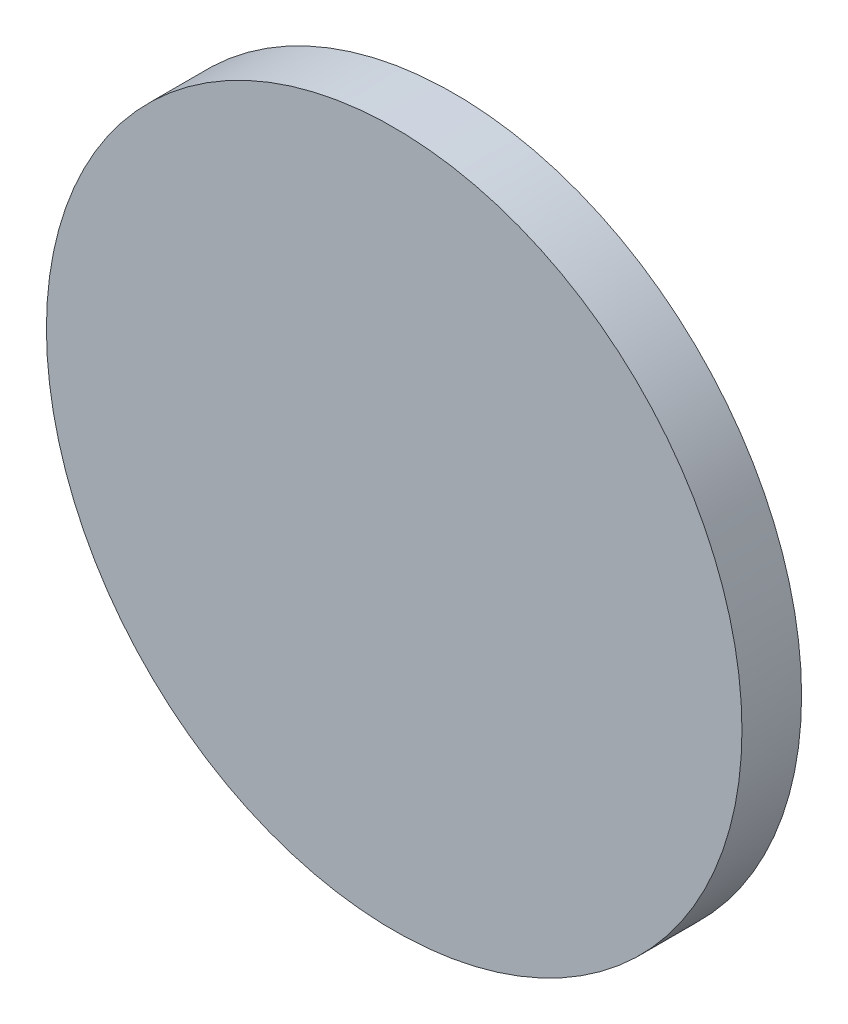
ISO-10303-21;
HEADER;
FILE_DESCRIPTION(('STEP AP214'),'2;1');
FILE_NAME('part.step','',(''),(''),'','','');
FILE_SCHEMA(('AUTOMOTIVE_DESIGN { 1 0 10303 214 1 1 1 1 }'));
ENDSEC;
DATA;
#1=APPLICATION_CONTEXT('core data for automotive mechanical design processes');
#2=APPLICATION_PROTOCOL_DEFINITION('international standard','automotive_design',2000,#1);
#3=PRODUCT_CONTEXT('',#1,'mechanical');
#4=PRODUCT('Part','Part','',(#3));
#5=PRODUCT_RELATED_PRODUCT_CATEGORY('part','',(#4));
#6=PRODUCT_DEFINITION_FORMATION('','',#4);
#7=PRODUCT_DEFINITION_CONTEXT('part definition',#1,'design');
#8=PRODUCT_DEFINITION('design','',#6,#7);
#9=PRODUCT_DEFINITION_SHAPE('','',#8);
#10=(LENGTH_UNIT() NAMED_UNIT(*) SI_UNIT(.MILLI.,.METRE.));
#11=(NAMED_UNIT(*) PLANE_ANGLE_UNIT() SI_UNIT($,.RADIAN.));
#12=(NAMED_UNIT(*) SI_UNIT($,.STERADIAN.) SOLID_ANGLE_UNIT());
#13=UNCERTAINTY_MEASURE_WITH_UNIT(LENGTH_MEASURE(1.E-05),#10,'distance_accuracy_value','');
#14=(GEOMETRIC_REPRESENTATION_CONTEXT(3) GLOBAL_UNCERTAINTY_ASSIGNED_CONTEXT((#13)) GLOBAL_UNIT_ASSIGNED_CONTEXT((#10,
#11,#12)) REPRESENTATION_CONTEXT('',''));
#15=CARTESIAN_POINT('',(0.,0.,0.));
#16=DIRECTION('',(0.,0.,1.));
#17=DIRECTION('',(1.,0.,0.));
#18=AXIS2_PLACEMENT_3D('',#15,#16,#17);
#19=CARTESIAN_POINT('',(10.07618,1.986280014875,0.76487));
#20=DIRECTION('',(0.,0.,-1.));
#21=DIRECTION('',(-1.,0.,0.));
#22=AXIS2_PLACEMENT_3D('',#19,#20,#21);
#23=PLANE('',#22);
#24=CARTESIAN_POINT('',(10.07618,1.986280014875,0.76487));
#25=DIRECTION('',(0.,0.,1.));
#26=DIRECTION('',(1.,0.,0.));
#27=AXIS2_PLACEMENT_3D('',#24,#25,#26);
#28=CIRCLE('',#27,0.200024667);
#29=CARTESIAN_POINT('',(10.276204667,1.986280014875,0.76487));
#30=VERTEX_POINT('',#29);
#31=EDGE_CURVE('E18',#30,#30,#28,.T.);
#32=ORIENTED_EDGE('',*,*,#31,.F.);
#33=EDGE_LOOP('',(#32));
#34=FACE_BOUND('',#33,.T.);
#35=ADVANCED_FACE('F15',(#34),#23,.T.);
#36=CARTESIAN_POINT('',(10.07618,1.986280014875,0.76487));
#37=DIRECTION('',(0.,0.,1.));
#38=DIRECTION('',(1.,0.,0.));
#39=AXIS2_PLACEMENT_3D('',#36,#37,#38);
#40=CYLINDRICAL_SURFACE('',#39,0.200024667);
#41=CARTESIAN_POINT('',(10.07618,1.986280014875,0.79916));
#42=DIRECTION('',(0.,0.,1.));
#43=DIRECTION('',(1.,0.,0.));
#44=AXIS2_PLACEMENT_3D('',#41,#42,#43);
#45=CIRCLE('',#44,0.200024667);
#46=CARTESIAN_POINT('',(10.276204667,1.986280014875,0.79916));
#47=VERTEX_POINT('',#46);
#48=EDGE_CURVE('E10',#47,#47,#45,.T.);
#49=ORIENTED_EDGE('',*,*,#48,.F.);
#50=EDGE_LOOP('',(#49));
#51=FACE_BOUND('',#50,.T.);
#52=ORIENTED_EDGE('',*,*,#31,.T.);
#53=EDGE_LOOP('',(#52));
#54=FACE_BOUND('',#53,.T.);
#55=ADVANCED_FACE('F27',(#51,#54),#40,.T.);
#56=CARTESIAN_POINT('',(10.07618,1.986280014875,0.79916));
#57=DIRECTION('',(0.,0.,1.));
#58=DIRECTION('',(1.,0.,0.));
#59=AXIS2_PLACEMENT_3D('',#56,#57,#58);
#60=PLANE('',#59);
#61=ORIENTED_EDGE('',*,*,#48,.T.);
#62=EDGE_LOOP('',(#61));
#63=FACE_BOUND('',#62,.T.);
#64=ADVANCED_FACE('F34',(#63),#60,.T.);
#65=CLOSED_SHELL('',(#35,#55,#64));
#66=MANIFOLD_SOLID_BREP('B1',#65);
#67=ADVANCED_BREP_SHAPE_REPRESENTATION('',(#18,#66),#14);
#68=SHAPE_DEFINITION_REPRESENTATION(#9,#67);
ENDSEC;
END-ISO-10303-21;
